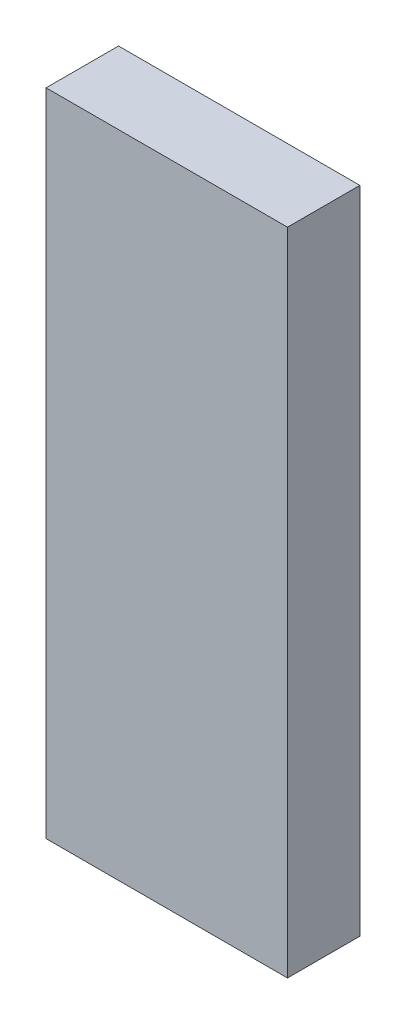
ISO-10303-21;
HEADER;
FILE_DESCRIPTION(('STEP AP214'),'2;1');
FILE_NAME('part.step','',(''),(''),'','','');
FILE_SCHEMA(('AUTOMOTIVE_DESIGN { 1 0 10303 214 1 1 1 1 }'));
ENDSEC;
DATA;
#1=APPLICATION_CONTEXT('core data for automotive mechanical design processes');
#2=APPLICATION_PROTOCOL_DEFINITION('international standard','automotive_design',2000,#1);
#3=PRODUCT_CONTEXT('',#1,'mechanical');
#4=PRODUCT('Part','Part','',(#3));
#5=PRODUCT_RELATED_PRODUCT_CATEGORY('part','',(#4));
#6=PRODUCT_DEFINITION_FORMATION('','',#4);
#7=PRODUCT_DEFINITION_CONTEXT('part definition',#1,'design');
#8=PRODUCT_DEFINITION('design','',#6,#7);
#9=PRODUCT_DEFINITION_SHAPE('','',#8);
#10=(LENGTH_UNIT() NAMED_UNIT(*) SI_UNIT(.MILLI.,.METRE.));
#11=(NAMED_UNIT(*) PLANE_ANGLE_UNIT() SI_UNIT($,.RADIAN.));
#12=(NAMED_UNIT(*) SI_UNIT($,.STERADIAN.) SOLID_ANGLE_UNIT());
#13=UNCERTAINTY_MEASURE_WITH_UNIT(LENGTH_MEASURE(1.E-05),#10,'distance_accuracy_value','');
#14=(GEOMETRIC_REPRESENTATION_CONTEXT(3) GLOBAL_UNCERTAINTY_ASSIGNED_CONTEXT((#13)) GLOBAL_UNIT_ASSIGNED_CONTEXT((#10,
#11,#12)) REPRESENTATION_CONTEXT('',''));
#15=CARTESIAN_POINT('',(0.,0.,0.));
#16=DIRECTION('',(0.,0.,1.));
#17=DIRECTION('',(1.,0.,0.));
#18=AXIS2_PLACEMENT_3D('',#15,#16,#17);
#19=CARTESIAN_POINT('',(-91.9526181270459,60.2766497461929,3.));
#20=DIRECTION('',(1.,0.,0.));
#21=DIRECTION('',(0.,1.,0.));
#22=AXIS2_PLACEMENT_3D('',#19,#20,#21);
#23=PLANE('',#22);
#24=DIRECTION('',(0.,-1.,0.));
#25=VECTOR('',#24,1.);
#26=CARTESIAN_POINT('',(-91.9526181270459,60.2766497461929,0.));
#27=LINE('',#26,#25);
#28=CARTESIAN_POINT('',(-91.9526181270459,60.2766497461929,0.));
#29=VERTEX_POINT('',#28);
#30=CARTESIAN_POINT('',(-91.9526181270459,33.3366497461929,0.));
#31=VERTEX_POINT('',#30);
#32=EDGE_CURVE('E96',#29,#31,#27,.T.);
#33=ORIENTED_EDGE('',*,*,#32,.T.);
#34=DIRECTION('',(0.,0.,-1.));
#35=VECTOR('',#34,1.);
#36=CARTESIAN_POINT('',(-91.9526181270459,33.3366497461929,3.));
#37=LINE('',#36,#35);
#38=CARTESIAN_POINT('',(-91.9526181270459,33.3366497461929,3.));
#39=VERTEX_POINT('',#38);
#40=EDGE_CURVE('E11',#39,#31,#37,.T.);
#41=ORIENTED_EDGE('',*,*,#40,.F.);
#42=DIRECTION('',(0.,-1.,0.));
#43=VECTOR('',#42,1.);
#44=CARTESIAN_POINT('',(-91.9526181270459,60.2766497461929,3.));
#45=LINE('',#44,#43);
#46=CARTESIAN_POINT('',(-91.9526181270459,60.2766497461929,3.));
#47=VERTEX_POINT('',#46);
#48=EDGE_CURVE('E84',#47,#39,#45,.T.);
#49=ORIENTED_EDGE('',*,*,#48,.F.);
#50=DIRECTION('',(0.,0.,-1.));
#51=VECTOR('',#50,1.);
#52=CARTESIAN_POINT('',(-91.9526181270459,60.2766497461929,3.));
#53=LINE('',#52,#51);
#54=EDGE_CURVE('E92',#47,#29,#53,.T.);
#55=ORIENTED_EDGE('',*,*,#54,.T.);
#56=EDGE_LOOP('',(#33,#41,#49,#55));
#57=FACE_BOUND('',#56,.T.);
#58=ADVANCED_FACE('F33',(#57),#23,.F.);
#59=CARTESIAN_POINT('',(-91.9526181270459,33.3366497461929,3.));
#60=DIRECTION('',(0.,1.,0.));
#61=DIRECTION('',(0.,0.,1.));
#62=AXIS2_PLACEMENT_3D('',#59,#60,#61);
#63=PLANE('',#62);
#64=DIRECTION('',(1.,0.,0.));
#65=VECTOR('',#64,1.);
#66=CARTESIAN_POINT('',(-91.9526181270459,33.3366497461929,0.));
#67=LINE('',#66,#65);
#68=CARTESIAN_POINT('',(-81.9526181270459,33.3366497461929,0.));
#69=VERTEX_POINT('',#68);
#70=EDGE_CURVE('E88',#31,#69,#67,.T.);
#71=ORIENTED_EDGE('',*,*,#70,.T.);
#72=DIRECTION('',(0.,0.,-1.));
#73=VECTOR('',#72,1.);
#74=CARTESIAN_POINT('',(-81.9526181270459,33.3366497461929,3.));
#75=LINE('',#74,#73);
#76=CARTESIAN_POINT('',(-81.9526181270459,33.3366497461929,3.));
#77=VERTEX_POINT('',#76);
#78=EDGE_CURVE('E41',#77,#69,#75,.T.);
#79=ORIENTED_EDGE('',*,*,#78,.F.);
#80=DIRECTION('',(1.,0.,0.));
#81=VECTOR('',#80,1.);
#82=CARTESIAN_POINT('',(-91.9526181270459,33.3366497461929,3.));
#83=LINE('',#82,#81);
#84=EDGE_CURVE('E79',#39,#77,#83,.T.);
#85=ORIENTED_EDGE('',*,*,#84,.F.);
#86=ORIENTED_EDGE('',*,*,#40,.T.);
#87=EDGE_LOOP('',(#71,#79,#85,#86));
#88=FACE_BOUND('',#87,.T.);
#89=ADVANCED_FACE('F87',(#88),#63,.F.);
#90=CARTESIAN_POINT('',(-81.9526181270459,60.2766497461929,3.));
#91=DIRECTION('',(-1.,0.,0.));
#92=DIRECTION('',(0.,-1.,0.));
#93=AXIS2_PLACEMENT_3D('',#90,#91,#92);
#94=PLANE('',#93);
#95=DIRECTION('',(0.,1.,0.));
#96=VECTOR('',#95,1.);
#97=CARTESIAN_POINT('',(-81.9526181270459,60.2766497461929,0.));
#98=LINE('',#97,#96);
#99=CARTESIAN_POINT('',(-81.9526181270459,60.2766497461929,0.));
#100=VERTEX_POINT('',#99);
#101=EDGE_CURVE('E66',#69,#100,#98,.T.);
#102=ORIENTED_EDGE('',*,*,#101,.T.);
#103=DIRECTION('',(0.,0.,-1.));
#104=VECTOR('',#103,1.);
#105=CARTESIAN_POINT('',(-81.9526181270459,60.2766497461929,3.));
#106=LINE('',#105,#104);
#107=CARTESIAN_POINT('',(-81.9526181270459,60.2766497461929,3.));
#108=VERTEX_POINT('',#107);
#109=EDGE_CURVE('E89',#108,#100,#106,.T.);
#110=ORIENTED_EDGE('',*,*,#109,.F.);
#111=DIRECTION('',(0.,1.,0.));
#112=VECTOR('',#111,1.);
#113=CARTESIAN_POINT('',(-81.9526181270459,60.2766497461929,3.));
#114=LINE('',#113,#112);
#115=EDGE_CURVE('E82',#77,#108,#114,.T.);
#116=ORIENTED_EDGE('',*,*,#115,.F.);
#117=ORIENTED_EDGE('',*,*,#78,.T.);
#118=EDGE_LOOP('',(#102,#110,#116,#117));
#119=FACE_BOUND('',#118,.T.);
#120=ADVANCED_FACE('F90',(#119),#94,.F.);
#121=CARTESIAN_POINT('',(-91.9526181270459,60.2766497461929,3.));
#122=DIRECTION('',(0.,-1.,0.));
#123=DIRECTION('',(0.,0.,-1.));
#124=AXIS2_PLACEMENT_3D('',#121,#122,#123);
#125=PLANE('',#124);
#126=DIRECTION('',(-1.,0.,0.));
#127=VECTOR('',#126,1.);
#128=CARTESIAN_POINT('',(-91.9526181270459,60.2766497461929,0.));
#129=LINE('',#128,#127);
#130=EDGE_CURVE('E72',#100,#29,#129,.T.);
#131=ORIENTED_EDGE('',*,*,#130,.T.);
#132=ORIENTED_EDGE('',*,*,#54,.F.);
#133=DIRECTION('',(-1.,0.,0.));
#134=VECTOR('',#133,1.);
#135=CARTESIAN_POINT('',(-91.9526181270459,60.2766497461929,3.));
#136=LINE('',#135,#134);
#137=EDGE_CURVE('E49',#108,#47,#136,.T.);
#138=ORIENTED_EDGE('',*,*,#137,.F.);
#139=ORIENTED_EDGE('',*,*,#109,.T.);
#140=EDGE_LOOP('',(#131,#132,#138,#139));
#141=FACE_BOUND('',#140,.T.);
#142=ADVANCED_FACE('F103',(#141),#125,.F.);
#143=CARTESIAN_POINT('',(0.,0.,3.));
#144=DIRECTION('',(0.,0.,1.));
#145=DIRECTION('',(1.,0.,0.));
#146=AXIS2_PLACEMENT_3D('',#143,#144,#145);
#147=PLANE('',#146);
#148=ORIENTED_EDGE('',*,*,#48,.T.);
#149=ORIENTED_EDGE('',*,*,#84,.T.);
#150=ORIENTED_EDGE('',*,*,#115,.T.);
#151=ORIENTED_EDGE('',*,*,#137,.T.);
#152=EDGE_LOOP('',(#148,#149,#150,#151));
#153=FACE_BOUND('',#152,.T.);
#154=ADVANCED_FACE('F80',(#153),#147,.T.);
#155=CARTESIAN_POINT('',(0.,0.,0.));
#156=DIRECTION('',(0.,0.,1.));
#157=DIRECTION('',(1.,0.,0.));
#158=AXIS2_PLACEMENT_3D('',#155,#156,#157);
#159=PLANE('',#158);
#160=ORIENTED_EDGE('',*,*,#32,.F.);
#161=ORIENTED_EDGE('',*,*,#130,.F.);
#162=ORIENTED_EDGE('',*,*,#101,.F.);
#163=ORIENTED_EDGE('',*,*,#70,.F.);
#164=EDGE_LOOP('',(#160,#161,#162,#163));
#165=FACE_BOUND('',#164,.T.);
#166=ADVANCED_FACE('F106',(#165),#159,.F.);
#167=CLOSED_SHELL('',(#58,#89,#120,#142,#154,#166));
#168=MANIFOLD_SOLID_BREP('B2',#167);
#169=ADVANCED_BREP_SHAPE_REPRESENTATION('',(#18,#168),#14);
#170=SHAPE_DEFINITION_REPRESENTATION(#9,#169);
ENDSEC;
END-ISO-10303-21;
